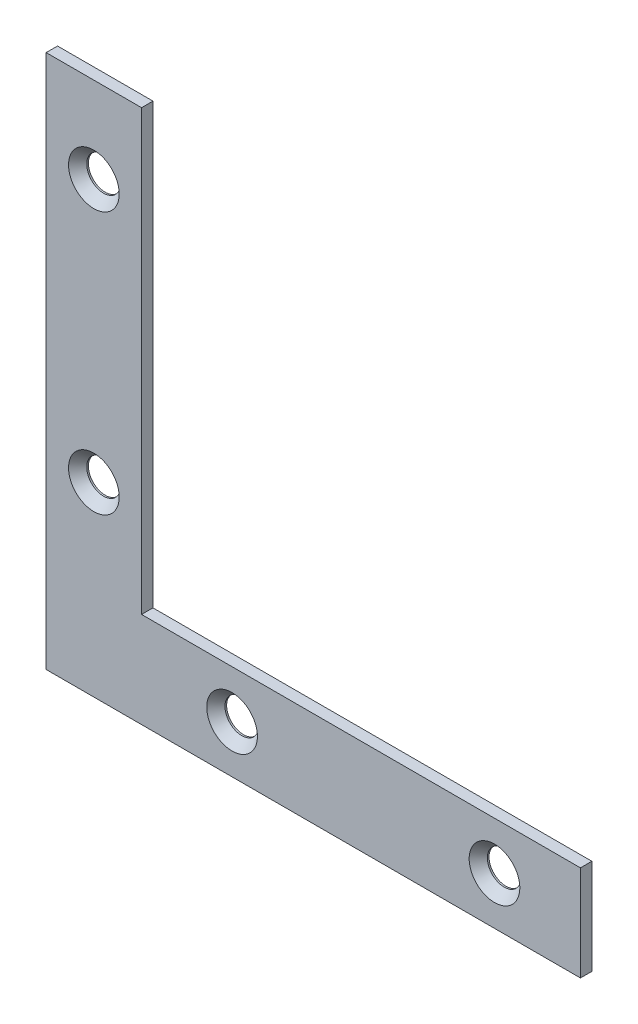
ISO-10303-21;
HEADER;
FILE_DESCRIPTION(('STEP AP214'),'2;1');
FILE_NAME('part.step','',(''),(''),'','','');
FILE_SCHEMA(('AUTOMOTIVE_DESIGN { 1 0 10303 214 1 1 1 1 }'));
ENDSEC;
DATA;
#1=APPLICATION_CONTEXT('core data for automotive mechanical design processes');
#2=APPLICATION_PROTOCOL_DEFINITION('international standard','automotive_design',2000,#1);
#3=PRODUCT_CONTEXT('',#1,'mechanical');
#4=PRODUCT('Part','Part','',(#3));
#5=PRODUCT_RELATED_PRODUCT_CATEGORY('part','',(#4));
#6=PRODUCT_DEFINITION_FORMATION('','',#4);
#7=PRODUCT_DEFINITION_CONTEXT('part definition',#1,'design');
#8=PRODUCT_DEFINITION('design','',#6,#7);
#9=PRODUCT_DEFINITION_SHAPE('','',#8);
#10=(LENGTH_UNIT() NAMED_UNIT(*) SI_UNIT(.MILLI.,.METRE.));
#11=(NAMED_UNIT(*) PLANE_ANGLE_UNIT() SI_UNIT($,.RADIAN.));
#12=(NAMED_UNIT(*) SI_UNIT($,.STERADIAN.) SOLID_ANGLE_UNIT());
#13=UNCERTAINTY_MEASURE_WITH_UNIT(LENGTH_MEASURE(1.E-05),#10,'distance_accuracy_value','');
#14=(GEOMETRIC_REPRESENTATION_CONTEXT(3) GLOBAL_UNCERTAINTY_ASSIGNED_CONTEXT((#13)) GLOBAL_UNIT_ASSIGNED_CONTEXT((#10,
#11,#12)) REPRESENTATION_CONTEXT('',''));
#15=CARTESIAN_POINT('',(0.,0.,0.));
#16=DIRECTION('',(0.,0.,1.));
#17=DIRECTION('',(1.,0.,0.));
#18=AXIS2_PLACEMENT_3D('',#15,#16,#17);
#19=CARTESIAN_POINT('',(-44.45,-44.45,0.94869));
#20=DIRECTION('',(1.,0.,0.));
#21=DIRECTION('',(0.,1.,0.));
#22=AXIS2_PLACEMENT_3D('',#19,#20,#21);
#23=PLANE('',#22);
#24=DIRECTION('',(0.,0.,-1.));
#25=VECTOR('',#24,1.);
#26=CARTESIAN_POINT('',(-44.45,44.45,0.94869));
#27=LINE('',#26,#25);
#28=CARTESIAN_POINT('',(-44.45,44.45,0.94869));
#29=VERTEX_POINT('',#28);
#30=CARTESIAN_POINT('',(-44.45,44.45,-0.94869));
#31=VERTEX_POINT('',#30);
#32=EDGE_CURVE('E110',#29,#31,#27,.T.);
#33=ORIENTED_EDGE('',*,*,#32,.T.);
#34=DIRECTION('',(0.,-1.,0.));
#35=VECTOR('',#34,1.);
#36=CARTESIAN_POINT('',(-44.45,-44.45,-0.94869));
#37=LINE('',#36,#35);
#38=CARTESIAN_POINT('',(-44.45,-44.45,-0.94869));
#39=VERTEX_POINT('',#38);
#40=EDGE_CURVE('E104',#31,#39,#37,.T.);
#41=ORIENTED_EDGE('',*,*,#40,.T.);
#42=DIRECTION('',(0.,0.,-1.));
#43=VECTOR('',#42,1.);
#44=CARTESIAN_POINT('',(-44.45,-44.45,0.94869));
#45=LINE('',#44,#43);
#46=CARTESIAN_POINT('',(-44.45,-44.45,0.94869));
#47=VERTEX_POINT('',#46);
#48=EDGE_CURVE('E11',#47,#39,#45,.T.);
#49=ORIENTED_EDGE('',*,*,#48,.F.);
#50=DIRECTION('',(0.,-1.,0.));
#51=VECTOR('',#50,1.);
#52=CARTESIAN_POINT('',(-44.45,-44.45,0.94869));
#53=LINE('',#52,#51);
#54=EDGE_CURVE('E129',#29,#47,#53,.T.);
#55=ORIENTED_EDGE('',*,*,#54,.F.);
#56=EDGE_LOOP('',(#33,#41,#49,#55));
#57=FACE_BOUND('',#56,.T.);
#58=ADVANCED_FACE('F38',(#57),#23,.F.);
#59=CARTESIAN_POINT('',(44.45,-44.45,0.94869));
#60=DIRECTION('',(0.,1.,0.));
#61=DIRECTION('',(0.,0.,1.));
#62=AXIS2_PLACEMENT_3D('',#59,#60,#61);
#63=PLANE('',#62);
#64=ORIENTED_EDGE('',*,*,#48,.T.);
#65=DIRECTION('',(1.,0.,0.));
#66=VECTOR('',#65,1.);
#67=CARTESIAN_POINT('',(44.45,-44.45,-0.94869));
#68=LINE('',#67,#66);
#69=CARTESIAN_POINT('',(44.45,-44.45,-0.94869));
#70=VERTEX_POINT('',#69);
#71=EDGE_CURVE('E94',#39,#70,#68,.T.);
#72=ORIENTED_EDGE('',*,*,#71,.T.);
#73=DIRECTION('',(0.,0.,-1.));
#74=VECTOR('',#73,1.);
#75=CARTESIAN_POINT('',(44.45,-44.45,0.94869));
#76=LINE('',#75,#74);
#77=CARTESIAN_POINT('',(44.45,-44.45,0.94869));
#78=VERTEX_POINT('',#77);
#79=EDGE_CURVE('E46',#78,#70,#76,.T.);
#80=ORIENTED_EDGE('',*,*,#79,.F.);
#81=DIRECTION('',(1.,0.,0.));
#82=VECTOR('',#81,1.);
#83=CARTESIAN_POINT('',(44.45,-44.45,0.94869));
#84=LINE('',#83,#82);
#85=EDGE_CURVE('E95',#47,#78,#84,.T.);
#86=ORIENTED_EDGE('',*,*,#85,.F.);
#87=EDGE_LOOP('',(#64,#72,#80,#86));
#88=FACE_BOUND('',#87,.T.);
#89=ADVANCED_FACE('F92',(#88),#63,.F.);
#90=CARTESIAN_POINT('',(44.45,-28.575,0.94869));
#91=DIRECTION('',(-1.,0.,0.));
#92=DIRECTION('',(0.,0.,1.));
#93=AXIS2_PLACEMENT_3D('',#90,#91,#92);
#94=PLANE('',#93);
#95=ORIENTED_EDGE('',*,*,#79,.T.);
#96=DIRECTION('',(0.,1.,0.));
#97=VECTOR('',#96,1.);
#98=CARTESIAN_POINT('',(44.45,-28.575,-0.94869));
#99=LINE('',#98,#97);
#100=CARTESIAN_POINT('',(44.45,-28.575,-0.94869));
#101=VERTEX_POINT('',#100);
#102=EDGE_CURVE('E108',#70,#101,#99,.T.);
#103=ORIENTED_EDGE('',*,*,#102,.T.);
#104=DIRECTION('',(0.,0.,-1.));
#105=VECTOR('',#104,1.);
#106=CARTESIAN_POINT('',(44.45,-28.575,0.94869));
#107=LINE('',#106,#105);
#108=CARTESIAN_POINT('',(44.45,-28.575,0.94869));
#109=VERTEX_POINT('',#108);
#110=EDGE_CURVE('E143',#109,#101,#107,.T.);
#111=ORIENTED_EDGE('',*,*,#110,.F.);
#112=DIRECTION('',(0.,1.,0.));
#113=VECTOR('',#112,1.);
#114=CARTESIAN_POINT('',(44.45,-28.575,0.94869));
#115=LINE('',#114,#113);
#116=EDGE_CURVE('E132',#78,#109,#115,.T.);
#117=ORIENTED_EDGE('',*,*,#116,.F.);
#118=EDGE_LOOP('',(#95,#103,#111,#117));
#119=FACE_BOUND('',#118,.T.);
#120=ADVANCED_FACE('F197',(#119),#94,.F.);
#121=CARTESIAN_POINT('',(-28.575,-28.575,0.94869));
#122=DIRECTION('',(0.,-1.,0.));
#123=DIRECTION('',(1.,0.,0.));
#124=AXIS2_PLACEMENT_3D('',#121,#122,#123);
#125=PLANE('',#124);
#126=ORIENTED_EDGE('',*,*,#110,.T.);
#127=DIRECTION('',(-1.,0.,0.));
#128=VECTOR('',#127,1.);
#129=CARTESIAN_POINT('',(-28.575,-28.575,-0.94869));
#130=LINE('',#129,#128);
#131=CARTESIAN_POINT('',(-28.575,-28.575,-0.94869));
#132=VERTEX_POINT('',#131);
#133=EDGE_CURVE('E121',#101,#132,#130,.T.);
#134=ORIENTED_EDGE('',*,*,#133,.T.);
#135=DIRECTION('',(0.,0.,-1.));
#136=VECTOR('',#135,1.);
#137=CARTESIAN_POINT('',(-28.575,-28.575,0.94869));
#138=LINE('',#137,#136);
#139=CARTESIAN_POINT('',(-28.575,-28.575,0.94869));
#140=VERTEX_POINT('',#139);
#141=EDGE_CURVE('E141',#140,#132,#138,.T.);
#142=ORIENTED_EDGE('',*,*,#141,.F.);
#143=DIRECTION('',(-1.,0.,0.));
#144=VECTOR('',#143,1.);
#145=CARTESIAN_POINT('',(-28.575,-28.575,0.94869));
#146=LINE('',#145,#144);
#147=EDGE_CURVE('E134',#109,#140,#146,.T.);
#148=ORIENTED_EDGE('',*,*,#147,.F.);
#149=EDGE_LOOP('',(#126,#134,#142,#148));
#150=FACE_BOUND('',#149,.T.);
#151=ADVANCED_FACE('F201',(#150),#125,.F.);
#152=CARTESIAN_POINT('',(-28.575,44.45,0.94869));
#153=DIRECTION('',(-1.,0.,0.));
#154=DIRECTION('',(0.,0.,1.));
#155=AXIS2_PLACEMENT_3D('',#152,#153,#154);
#156=PLANE('',#155);
#157=ORIENTED_EDGE('',*,*,#141,.T.);
#158=DIRECTION('',(0.,1.,0.));
#159=VECTOR('',#158,1.);
#160=CARTESIAN_POINT('',(-28.575,44.45,-0.94869));
#161=LINE('',#160,#159);
#162=CARTESIAN_POINT('',(-28.575,44.45,-0.94869));
#163=VERTEX_POINT('',#162);
#164=EDGE_CURVE('E124',#132,#163,#161,.T.);
#165=ORIENTED_EDGE('',*,*,#164,.T.);
#166=DIRECTION('',(0.,0.,-1.));
#167=VECTOR('',#166,1.);
#168=CARTESIAN_POINT('',(-28.575,44.45,0.94869));
#169=LINE('',#168,#167);
#170=CARTESIAN_POINT('',(-28.575,44.45,0.94869));
#171=VERTEX_POINT('',#170);
#172=EDGE_CURVE('E139',#171,#163,#169,.T.);
#173=ORIENTED_EDGE('',*,*,#172,.F.);
#174=DIRECTION('',(0.,1.,0.));
#175=VECTOR('',#174,1.);
#176=CARTESIAN_POINT('',(-28.575,44.45,0.94869));
#177=LINE('',#176,#175);
#178=EDGE_CURVE('E59',#140,#171,#177,.T.);
#179=ORIENTED_EDGE('',*,*,#178,.F.);
#180=EDGE_LOOP('',(#157,#165,#173,#179));
#181=FACE_BOUND('',#180,.T.);
#182=ADVANCED_FACE('F204',(#181),#156,.F.);
#183=CARTESIAN_POINT('',(-44.45,44.45,0.94869));
#184=DIRECTION('',(0.,-1.,0.));
#185=DIRECTION('',(1.,0.,0.));
#186=AXIS2_PLACEMENT_3D('',#183,#184,#185);
#187=PLANE('',#186);
#188=ORIENTED_EDGE('',*,*,#172,.T.);
#189=DIRECTION('',(-1.,0.,0.));
#190=VECTOR('',#189,1.);
#191=CARTESIAN_POINT('',(-44.45,44.45,-0.94869));
#192=LINE('',#191,#190);
#193=EDGE_CURVE('E127',#163,#31,#192,.T.);
#194=ORIENTED_EDGE('',*,*,#193,.T.);
#195=ORIENTED_EDGE('',*,*,#32,.F.);
#196=DIRECTION('',(-1.,0.,0.));
#197=VECTOR('',#196,1.);
#198=CARTESIAN_POINT('',(-44.45,44.45,0.94869));
#199=LINE('',#198,#197);
#200=EDGE_CURVE('E54',#171,#29,#199,.T.);
#201=ORIENTED_EDGE('',*,*,#200,.F.);
#202=EDGE_LOOP('',(#188,#194,#195,#201));
#203=FACE_BOUND('',#202,.T.);
#204=ADVANCED_FACE('F187',(#203),#187,.F.);
#205=CARTESIAN_POINT('',(0.,0.,0.94869));
#206=DIRECTION('',(0.,0.,-1.));
#207=DIRECTION('',(-1.,0.,0.));
#208=AXIS2_PLACEMENT_3D('',#205,#206,#207);
#209=PLANE('',#208);
#210=CARTESIAN_POINT('',(-36.5125,30.1498,0.94869));
#211=DIRECTION('',(0.,0.,1.));
#212=DIRECTION('',(1.,0.,0.));
#213=AXIS2_PLACEMENT_3D('',#210,#211,#212);
#214=CIRCLE('',#213,4.2164);
#215=CARTESIAN_POINT('',(-32.2961,30.1498,0.94869));
#216=VERTEX_POINT('',#215);
#217=EDGE_CURVE('E150',#216,#216,#214,.T.);
#218=ORIENTED_EDGE('',*,*,#217,.F.);
#219=EDGE_LOOP('',(#218));
#220=FACE_BOUND('',#219,.T.);
#221=CARTESIAN_POINT('',(-36.5125,-13.5128,0.94869));
#222=DIRECTION('',(0.,0.,1.));
#223=DIRECTION('',(1.,0.,0.));
#224=AXIS2_PLACEMENT_3D('',#221,#222,#223);
#225=CIRCLE('',#224,4.21640000000001);
#226=CARTESIAN_POINT('',(-32.2961,-13.5128,0.94869));
#227=VERTEX_POINT('',#226);
#228=EDGE_CURVE('E175',#227,#227,#225,.T.);
#229=ORIENTED_EDGE('',*,*,#228,.F.);
#230=EDGE_LOOP('',(#229));
#231=FACE_BOUND('',#230,.T.);
#232=CARTESIAN_POINT('',(-13.5128,-36.5125,0.94869));
#233=DIRECTION('',(0.,0.,1.));
#234=DIRECTION('',(1.,0.,0.));
#235=AXIS2_PLACEMENT_3D('',#232,#233,#234);
#236=CIRCLE('',#235,4.2164);
#237=CARTESIAN_POINT('',(-9.29640000000001,-36.5125,0.94869));
#238=VERTEX_POINT('',#237);
#239=EDGE_CURVE('E172',#238,#238,#236,.T.);
#240=ORIENTED_EDGE('',*,*,#239,.F.);
#241=EDGE_LOOP('',(#240));
#242=FACE_BOUND('',#241,.T.);
#243=CARTESIAN_POINT('',(30.1498,-36.5125,0.94869));
#244=DIRECTION('',(0.,0.,1.));
#245=DIRECTION('',(1.,0.,0.));
#246=AXIS2_PLACEMENT_3D('',#243,#244,#245);
#247=CIRCLE('',#246,4.21640000000001);
#248=CARTESIAN_POINT('',(34.3662,-36.5125,0.94869));
#249=VERTEX_POINT('',#248);
#250=EDGE_CURVE('E169',#249,#249,#247,.T.);
#251=ORIENTED_EDGE('',*,*,#250,.F.);
#252=EDGE_LOOP('',(#251));
#253=FACE_BOUND('',#252,.T.);
#254=ORIENTED_EDGE('',*,*,#54,.T.);
#255=ORIENTED_EDGE('',*,*,#85,.T.);
#256=ORIENTED_EDGE('',*,*,#116,.T.);
#257=ORIENTED_EDGE('',*,*,#147,.T.);
#258=ORIENTED_EDGE('',*,*,#178,.T.);
#259=ORIENTED_EDGE('',*,*,#200,.T.);
#260=EDGE_LOOP('',(#254,#255,#256,#257,#258,#259));
#261=FACE_BOUND('',#260,.T.);
#262=ADVANCED_FACE('F184',(#220,#231,#242,#253,#261),#209,.F.);
#263=CARTESIAN_POINT('',(0.,0.,-0.94869));
#264=DIRECTION('',(0.,0.,-1.));
#265=DIRECTION('',(-1.,0.,0.));
#266=AXIS2_PLACEMENT_3D('',#263,#264,#265);
#267=PLANE('',#266);
#268=CARTESIAN_POINT('',(-36.5125,30.1498,-0.94869));
#269=DIRECTION('',(0.,0.,1.));
#270=DIRECTION('',(1.,0.,0.));
#271=AXIS2_PLACEMENT_3D('',#268,#269,#270);
#272=CIRCLE('',#271,2.8067);
#273=CARTESIAN_POINT('',(-33.7058,30.1498,-0.94869));
#274=VERTEX_POINT('',#273);
#275=EDGE_CURVE('E111',#274,#274,#272,.T.);
#276=ORIENTED_EDGE('',*,*,#275,.T.);
#277=EDGE_LOOP('',(#276));
#278=FACE_BOUND('',#277,.T.);
#279=CARTESIAN_POINT('',(-36.5125,-13.5128,-0.94869));
#280=DIRECTION('',(0.,0.,1.));
#281=DIRECTION('',(1.,0.,0.));
#282=AXIS2_PLACEMENT_3D('',#279,#280,#281);
#283=CIRCLE('',#282,2.8067);
#284=CARTESIAN_POINT('',(-33.7058,-13.5128,-0.94869));
#285=VERTEX_POINT('',#284);
#286=EDGE_CURVE('E114',#285,#285,#283,.T.);
#287=ORIENTED_EDGE('',*,*,#286,.T.);
#288=EDGE_LOOP('',(#287));
#289=FACE_BOUND('',#288,.T.);
#290=CARTESIAN_POINT('',(-13.5128,-36.5125,-0.94869));
#291=DIRECTION('',(0.,0.,1.));
#292=DIRECTION('',(1.,0.,0.));
#293=AXIS2_PLACEMENT_3D('',#290,#291,#292);
#294=CIRCLE('',#293,2.8067);
#295=CARTESIAN_POINT('',(-10.7061,-36.5125,-0.94869));
#296=VERTEX_POINT('',#295);
#297=EDGE_CURVE('E160',#296,#296,#294,.T.);
#298=ORIENTED_EDGE('',*,*,#297,.T.);
#299=EDGE_LOOP('',(#298));
#300=FACE_BOUND('',#299,.T.);
#301=CARTESIAN_POINT('',(30.1498,-36.5125,-0.94869));
#302=DIRECTION('',(0.,0.,1.));
#303=DIRECTION('',(1.,0.,0.));
#304=AXIS2_PLACEMENT_3D('',#301,#302,#303);
#305=CIRCLE('',#304,2.80670000000001);
#306=CARTESIAN_POINT('',(32.9565,-36.5125,-0.94869));
#307=VERTEX_POINT('',#306);
#308=EDGE_CURVE('E117',#307,#307,#305,.T.);
#309=ORIENTED_EDGE('',*,*,#308,.T.);
#310=EDGE_LOOP('',(#309));
#311=FACE_BOUND('',#310,.T.);
#312=ORIENTED_EDGE('',*,*,#40,.F.);
#313=ORIENTED_EDGE('',*,*,#193,.F.);
#314=ORIENTED_EDGE('',*,*,#164,.F.);
#315=ORIENTED_EDGE('',*,*,#133,.F.);
#316=ORIENTED_EDGE('',*,*,#102,.F.);
#317=ORIENTED_EDGE('',*,*,#71,.F.);
#318=EDGE_LOOP('',(#312,#313,#314,#315,#316,#317));
#319=FACE_BOUND('',#318,.T.);
#320=ADVANCED_FACE('F102',(#278,#289,#300,#311,#319),#267,.T.);
#321=CARTESIAN_POINT('',(30.1498,-36.5125,-0.94869));
#322=DIRECTION('',(0.,0.,1.));
#323=DIRECTION('',(1.,0.,0.));
#324=AXIS2_PLACEMENT_3D('',#321,#322,#323);
#325=CYLINDRICAL_SURFACE('',#324,2.80670000000001);
#326=CARTESIAN_POINT('',(30.1498,-36.5125,-0.67298434365946));
#327=DIRECTION('',(0.,0.,1.));
#328=DIRECTION('',(1.,0.,0.));
#329=AXIS2_PLACEMENT_3D('',#326,#327,#328);
#330=CIRCLE('',#329,2.80670000000001);
#331=CARTESIAN_POINT('',(32.9565,-36.5125,-0.67298434365946));
#332=VERTEX_POINT('',#331);
#333=EDGE_CURVE('E41',#332,#332,#330,.T.);
#334=ORIENTED_EDGE('',*,*,#333,.T.);
#335=EDGE_LOOP('',(#334));
#336=FACE_BOUND('',#335,.T.);
#337=ORIENTED_EDGE('',*,*,#308,.F.);
#338=EDGE_LOOP('',(#337));
#339=FACE_BOUND('',#338,.T.);
#340=ADVANCED_FACE('F244',(#336,#339),#325,.F.);
#341=CARTESIAN_POINT('',(-13.5128,-36.5125,-0.94869));
#342=DIRECTION('',(0.,0.,1.));
#343=DIRECTION('',(1.,0.,0.));
#344=AXIS2_PLACEMENT_3D('',#341,#342,#343);
#345=CYLINDRICAL_SURFACE('',#344,2.8067);
#346=CARTESIAN_POINT('',(-13.5128,-36.5125,-0.672984343659456));
#347=DIRECTION('',(0.,0.,1.));
#348=DIRECTION('',(1.,0.,0.));
#349=AXIS2_PLACEMENT_3D('',#346,#347,#348);
#350=CIRCLE('',#349,2.8067);
#351=CARTESIAN_POINT('',(-10.7061,-36.5125,-0.672984343659456));
#352=VERTEX_POINT('',#351);
#353=EDGE_CURVE('E152',#352,#352,#350,.T.);
#354=ORIENTED_EDGE('',*,*,#353,.T.);
#355=EDGE_LOOP('',(#354));
#356=FACE_BOUND('',#355,.T.);
#357=ORIENTED_EDGE('',*,*,#297,.F.);
#358=EDGE_LOOP('',(#357));
#359=FACE_BOUND('',#358,.T.);
#360=ADVANCED_FACE('F259',(#356,#359),#345,.F.);
#361=CARTESIAN_POINT('',(-36.5125,-13.5128,-0.94869));
#362=DIRECTION('',(0.,0.,1.));
#363=DIRECTION('',(1.,0.,0.));
#364=AXIS2_PLACEMENT_3D('',#361,#362,#363);
#365=CYLINDRICAL_SURFACE('',#364,2.8067);
#366=CARTESIAN_POINT('',(-36.5125,-13.5128,-0.672984343659461));
#367=DIRECTION('',(0.,0.,1.));
#368=DIRECTION('',(1.,0.,0.));
#369=AXIS2_PLACEMENT_3D('',#366,#367,#368);
#370=CIRCLE('',#369,2.8067);
#371=CARTESIAN_POINT('',(-33.7058,-13.5128,-0.672984343659461));
#372=VERTEX_POINT('',#371);
#373=EDGE_CURVE('E149',#372,#372,#370,.T.);
#374=ORIENTED_EDGE('',*,*,#373,.T.);
#375=EDGE_LOOP('',(#374));
#376=FACE_BOUND('',#375,.T.);
#377=ORIENTED_EDGE('',*,*,#286,.F.);
#378=EDGE_LOOP('',(#377));
#379=FACE_BOUND('',#378,.T.);
#380=ADVANCED_FACE('F268',(#376,#379),#365,.F.);
#381=CARTESIAN_POINT('',(-36.5125,30.1498,-0.94869));
#382=DIRECTION('',(0.,0.,1.));
#383=DIRECTION('',(1.,0.,0.));
#384=AXIS2_PLACEMENT_3D('',#381,#382,#383);
#385=CYLINDRICAL_SURFACE('',#384,2.8067);
#386=CARTESIAN_POINT('',(-36.5125,30.1498,-0.672984343659452));
#387=DIRECTION('',(0.,0.,1.));
#388=DIRECTION('',(1.,0.,0.));
#389=AXIS2_PLACEMENT_3D('',#386,#387,#388);
#390=CIRCLE('',#389,2.8067);
#391=CARTESIAN_POINT('',(-33.7058,30.1498,-0.672984343659452));
#392=VERTEX_POINT('',#391);
#393=EDGE_CURVE('E146',#392,#392,#390,.T.);
#394=ORIENTED_EDGE('',*,*,#393,.T.);
#395=EDGE_LOOP('',(#394));
#396=FACE_BOUND('',#395,.T.);
#397=ORIENTED_EDGE('',*,*,#275,.F.);
#398=EDGE_LOOP('',(#397));
#399=FACE_BOUND('',#398,.T.);
#400=ADVANCED_FACE('F277',(#396,#399),#385,.F.);
#401=CARTESIAN_POINT('',(-36.5125,30.1498,0.94869));
#402=DIRECTION('',(0.,0.,1.));
#403=DIRECTION('',(1.,0.,0.));
#404=AXIS2_PLACEMENT_3D('',#401,#402,#403);
#405=CONICAL_SURFACE('',#404,4.2164,0.715584993317677);
#406=ORIENTED_EDGE('',*,*,#217,.T.);
#407=EDGE_LOOP('',(#406));
#408=FACE_BOUND('',#407,.T.);
#409=ORIENTED_EDGE('',*,*,#393,.F.);
#410=EDGE_LOOP('',(#409));
#411=FACE_BOUND('',#410,.T.);
#412=ADVANCED_FACE('F181',(#408,#411),#405,.F.);
#413=CARTESIAN_POINT('',(-36.5125,-13.5128,0.94869));
#414=DIRECTION('',(0.,0.,1.));
#415=DIRECTION('',(1.,0.,0.));
#416=AXIS2_PLACEMENT_3D('',#413,#414,#415);
#417=CONICAL_SURFACE('',#416,4.21640000000001,0.715584993317677);
#418=ORIENTED_EDGE('',*,*,#228,.T.);
#419=EDGE_LOOP('',(#418));
#420=FACE_BOUND('',#419,.T.);
#421=ORIENTED_EDGE('',*,*,#373,.F.);
#422=EDGE_LOOP('',(#421));
#423=FACE_BOUND('',#422,.T.);
#424=ADVANCED_FACE('F296',(#420,#423),#417,.F.);
#425=CARTESIAN_POINT('',(-13.5128,-36.5125,0.94869));
#426=DIRECTION('',(0.,0.,1.));
#427=DIRECTION('',(1.,0.,0.));
#428=AXIS2_PLACEMENT_3D('',#425,#426,#427);
#429=CONICAL_SURFACE('',#428,4.2164,0.715584993317677);
#430=ORIENTED_EDGE('',*,*,#239,.T.);
#431=EDGE_LOOP('',(#430));
#432=FACE_BOUND('',#431,.T.);
#433=ORIENTED_EDGE('',*,*,#353,.F.);
#434=EDGE_LOOP('',(#433));
#435=FACE_BOUND('',#434,.T.);
#436=ADVANCED_FACE('F305',(#432,#435),#429,.F.);
#437=CARTESIAN_POINT('',(30.1498,-36.5125,0.94869));
#438=DIRECTION('',(0.,0.,1.));
#439=DIRECTION('',(1.,0.,0.));
#440=AXIS2_PLACEMENT_3D('',#437,#438,#439);
#441=CONICAL_SURFACE('',#440,4.21640000000001,0.715584993317677);
#442=ORIENTED_EDGE('',*,*,#250,.T.);
#443=EDGE_LOOP('',(#442));
#444=FACE_BOUND('',#443,.T.);
#445=ORIENTED_EDGE('',*,*,#333,.F.);
#446=EDGE_LOOP('',(#445));
#447=FACE_BOUND('',#446,.T.);
#448=ADVANCED_FACE('F315',(#444,#447),#441,.F.);
#449=CLOSED_SHELL('',(#58,#89,#120,#151,#182,#204,#262,#320,#340,#360,#380,#400,#412,#424,#436,#448));
#450=MANIFOLD_SOLID_BREP('B2',#449);
#451=ADVANCED_BREP_SHAPE_REPRESENTATION('',(#18,#450),#14);
#452=SHAPE_DEFINITION_REPRESENTATION(#9,#451);
ENDSEC;
END-ISO-10303-21;
